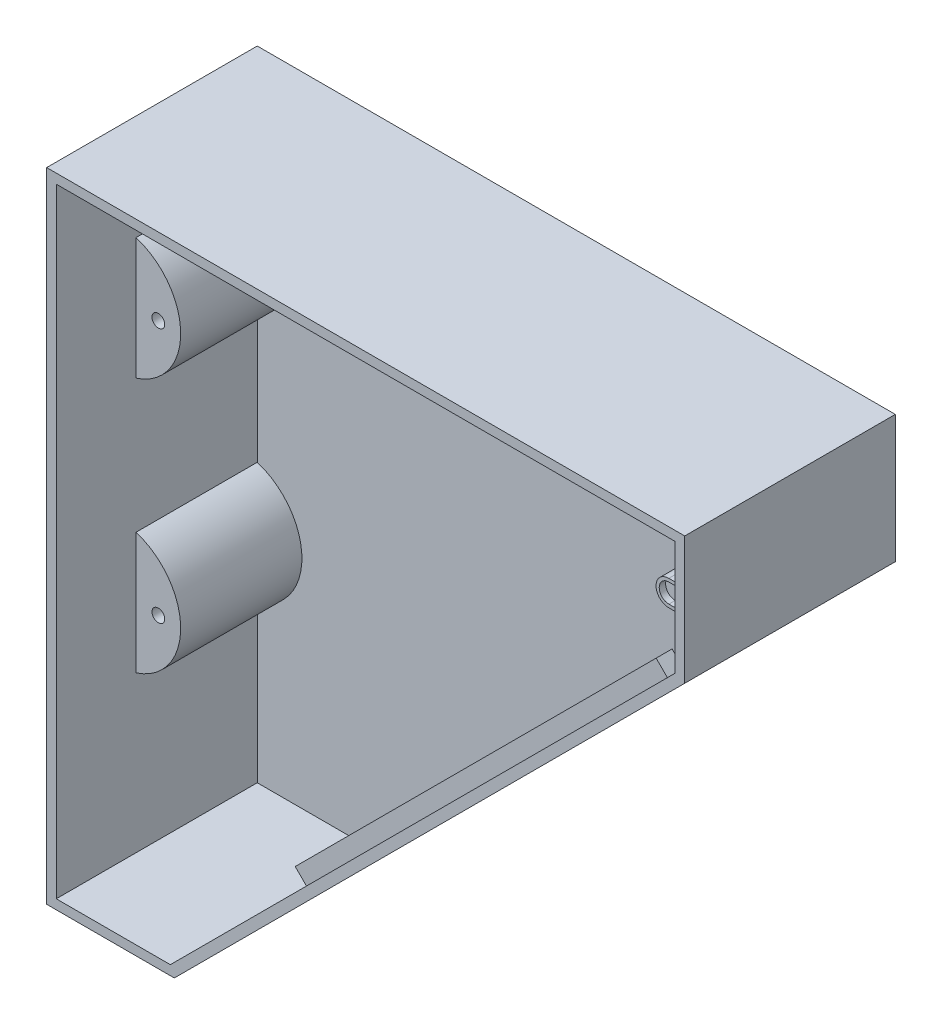
ISO-10303-21;
HEADER;
FILE_DESCRIPTION(('STEP AP214'),'2;1');
FILE_NAME('part.step','',(''),(''),'','','');
FILE_SCHEMA(('AUTOMOTIVE_DESIGN { 1 0 10303 214 1 1 1 1 }'));
ENDSEC;
DATA;
#1=APPLICATION_CONTEXT('core data for automotive mechanical design processes');
#2=APPLICATION_PROTOCOL_DEFINITION('international standard','automotive_design',2000,#1);
#3=PRODUCT_CONTEXT('',#1,'mechanical');
#4=PRODUCT('Part','Part','',(#3));
#5=PRODUCT_RELATED_PRODUCT_CATEGORY('part','',(#4));
#6=PRODUCT_DEFINITION_FORMATION('','',#4);
#7=PRODUCT_DEFINITION_CONTEXT('part definition',#1,'design');
#8=PRODUCT_DEFINITION('design','',#6,#7);
#9=PRODUCT_DEFINITION_SHAPE('','',#8);
#10=(LENGTH_UNIT() NAMED_UNIT(*) SI_UNIT(.MILLI.,.METRE.));
#11=(NAMED_UNIT(*) PLANE_ANGLE_UNIT() SI_UNIT($,.RADIAN.));
#12=(NAMED_UNIT(*) SI_UNIT($,.STERADIAN.) SOLID_ANGLE_UNIT());
#13=UNCERTAINTY_MEASURE_WITH_UNIT(LENGTH_MEASURE(1.E-05),#10,'distance_accuracy_value','');
#14=(GEOMETRIC_REPRESENTATION_CONTEXT(3) GLOBAL_UNCERTAINTY_ASSIGNED_CONTEXT((#13)) GLOBAL_UNIT_ASSIGNED_CONTEXT((#10,
#11,#12)) REPRESENTATION_CONTEXT('',''));
#15=CARTESIAN_POINT('',(0.,0.,0.));
#16=DIRECTION('',(0.,0.,1.));
#17=DIRECTION('',(1.,0.,0.));
#18=AXIS2_PLACEMENT_3D('',#15,#16,#17);
#19=CARTESIAN_POINT('',(197.,200.,70.));
#20=DIRECTION('',(-1.,0.,0.));
#21=DIRECTION('',(0.,0.,1.));
#22=AXIS2_PLACEMENT_3D('',#19,#20,#21);
#23=PLANE('',#22);
#24=DIRECTION('',(0.,1.,0.));
#25=VECTOR('',#24,1.);
#26=CARTESIAN_POINT('',(197.,176.,64.));
#27=LINE('',#26,#25);
#28=CARTESIAN_POINT('',(197.,176.,64.));
#29=VERTEX_POINT('',#28);
#30=CARTESIAN_POINT('',(197.,177.,64.));
#31=VERTEX_POINT('',#30);
#32=EDGE_CURVE('E248',#29,#31,#27,.T.);
#33=ORIENTED_EDGE('',*,*,#32,.F.);
#34=DIRECTION('',(0.,0.,1.));
#35=VECTOR('',#34,1.);
#36=CARTESIAN_POINT('',(197.,176.,3.));
#37=LINE('',#36,#35);
#38=CARTESIAN_POINT('',(197.,176.,3.));
#39=VERTEX_POINT('',#38);
#40=EDGE_CURVE('E60',#39,#29,#37,.T.);
#41=ORIENTED_EDGE('',*,*,#40,.F.);
#42=DIRECTION('',(0.,1.,0.));
#43=VECTOR('',#42,1.);
#44=CARTESIAN_POINT('',(197.,0.,3.));
#45=LINE('',#44,#43);
#46=CARTESIAN_POINT('',(197.,161.242640687119,3.));
#47=VERTEX_POINT('',#46);
#48=EDGE_CURVE('E443',#47,#39,#45,.T.);
#49=ORIENTED_EDGE('',*,*,#48,.F.);
#50=DIRECTION('',(0.,0.,-1.));
#51=VECTOR('',#50,1.);
#52=CARTESIAN_POINT('',(197.,161.242640687119,70.));
#53=LINE('',#52,#51);
#54=CARTESIAN_POINT('',(197.,161.242640687119,66.));
#55=VERTEX_POINT('',#54);
#56=EDGE_CURVE('E432',#55,#47,#53,.T.);
#57=ORIENTED_EDGE('',*,*,#56,.F.);
#58=DIRECTION('',(0.,-1.,0.));
#59=VECTOR('',#58,1.);
#60=CARTESIAN_POINT('',(197.,200.,66.));
#61=LINE('',#60,#59);
#62=CARTESIAN_POINT('',(197.,197.,66.));
#63=VERTEX_POINT('',#62);
#64=EDGE_CURVE('E413',#63,#55,#61,.T.);
#65=ORIENTED_EDGE('',*,*,#64,.F.);
#66=DIRECTION('',(0.,0.,-1.));
#67=VECTOR('',#66,1.);
#68=CARTESIAN_POINT('',(197.,197.,70.));
#69=LINE('',#68,#67);
#70=CARTESIAN_POINT('',(197.,197.,3.));
#71=VERTEX_POINT('',#70);
#72=EDGE_CURVE('E442',#63,#71,#69,.T.);
#73=ORIENTED_EDGE('',*,*,#72,.T.);
#74=CARTESIAN_POINT('',(197.,184.,3.));
#75=VERTEX_POINT('',#74);
#76=EDGE_CURVE('E440',#75,#71,#45,.T.);
#77=ORIENTED_EDGE('',*,*,#76,.F.);
#78=DIRECTION('',(0.,0.,1.));
#79=VECTOR('',#78,1.);
#80=CARTESIAN_POINT('',(197.,184.,3.));
#81=LINE('',#80,#79);
#82=CARTESIAN_POINT('',(197.,184.,64.));
#83=VERTEX_POINT('',#82);
#84=EDGE_CURVE('E297',#75,#83,#81,.T.);
#85=ORIENTED_EDGE('',*,*,#84,.T.);
#86=DIRECTION('',(0.,1.,0.));
#87=VECTOR('',#86,1.);
#88=CARTESIAN_POINT('',(197.,183.,64.));
#89=LINE('',#88,#87);
#90=CARTESIAN_POINT('',(197.,183.,64.));
#91=VERTEX_POINT('',#90);
#92=EDGE_CURVE('E269',#91,#83,#89,.T.);
#93=ORIENTED_EDGE('',*,*,#92,.F.);
#94=DIRECTION('',(0.,0.,-1.));
#95=VECTOR('',#94,1.);
#96=CARTESIAN_POINT('',(197.,183.,64.));
#97=LINE('',#96,#95);
#98=CARTESIAN_POINT('',(197.,183.,62.));
#99=VERTEX_POINT('',#98);
#100=EDGE_CURVE('E272',#91,#99,#97,.T.);
#101=ORIENTED_EDGE('',*,*,#100,.T.);
#102=DIRECTION('',(0.,1.,0.));
#103=VECTOR('',#102,1.);
#104=CARTESIAN_POINT('',(197.,184.,62.));
#105=LINE('',#104,#103);
#106=CARTESIAN_POINT('',(197.,177.,62.));
#107=VERTEX_POINT('',#106);
#108=EDGE_CURVE('E286',#107,#99,#105,.T.);
#109=ORIENTED_EDGE('',*,*,#108,.F.);
#110=DIRECTION('',(0.,0.,-1.));
#111=VECTOR('',#110,1.);
#112=CARTESIAN_POINT('',(197.,177.,64.));
#113=LINE('',#112,#111);
#114=EDGE_CURVE('E52',#31,#107,#113,.T.);
#115=ORIENTED_EDGE('',*,*,#114,.F.);
#116=EDGE_LOOP('',(#33,#41,#49,#57,#65,#73,#77,#85,#93,#101,#109,#115));
#117=FACE_BOUND('',#116,.T.);
#118=ADVANCED_FACE('F37',(#117),#23,.T.);
#119=CARTESIAN_POINT('',(193.,180.,62.));
#120=DIRECTION('',(0.,0.,1.));
#121=DIRECTION('',(1.,0.,0.));
#122=AXIS2_PLACEMENT_3D('',#119,#120,#121);
#123=PLANE('',#122);
#124=CARTESIAN_POINT('',(193.,180.,62.));
#125=DIRECTION('',(0.,0.,-1.));
#126=DIRECTION('',(1.,0.,0.));
#127=AXIS2_PLACEMENT_3D('',#124,#125,#126);
#128=CIRCLE('',#127,3.);
#129=CARTESIAN_POINT('',(193.,177.,62.));
#130=VERTEX_POINT('',#129);
#131=CARTESIAN_POINT('',(193.,183.,62.));
#132=VERTEX_POINT('',#131);
#133=EDGE_CURVE('E258',#130,#132,#128,.T.);
#134=ORIENTED_EDGE('',*,*,#133,.F.);
#135=DIRECTION('',(-1.,0.,0.));
#136=VECTOR('',#135,1.);
#137=CARTESIAN_POINT('',(193.,177.,62.));
#138=LINE('',#137,#136);
#139=EDGE_CURVE('E273',#107,#130,#138,.T.);
#140=ORIENTED_EDGE('',*,*,#139,.F.);
#141=ORIENTED_EDGE('',*,*,#108,.T.);
#142=DIRECTION('',(1.,0.,0.));
#143=VECTOR('',#142,1.);
#144=CARTESIAN_POINT('',(193.,183.,62.));
#145=LINE('',#144,#143);
#146=EDGE_CURVE('E255',#132,#99,#145,.T.);
#147=ORIENTED_EDGE('',*,*,#146,.F.);
#148=EDGE_LOOP('',(#134,#140,#141,#147));
#149=FACE_BOUND('',#148,.T.);
#150=ADVANCED_FACE('F516',(#149),#123,.T.);
#151=CARTESIAN_POINT('',(0.,197.,70.));
#152=DIRECTION('',(0.,-1.,0.));
#153=DIRECTION('',(0.,0.,-1.));
#154=AXIS2_PLACEMENT_3D('',#151,#152,#153);
#155=PLANE('',#154);
#156=DIRECTION('',(1.,0.,0.));
#157=VECTOR('',#156,1.);
#158=CARTESIAN_POINT('',(0.,197.,66.));
#159=LINE('',#158,#157);
#160=CARTESIAN_POINT('',(3.,197.,66.));
#161=VERTEX_POINT('',#160);
#162=EDGE_CURVE('E410',#161,#63,#159,.T.);
#163=ORIENTED_EDGE('',*,*,#162,.F.);
#164=DIRECTION('',(0.,0.,-1.));
#165=VECTOR('',#164,1.);
#166=CARTESIAN_POINT('',(3.,197.,70.));
#167=LINE('',#166,#165);
#168=CARTESIAN_POINT('',(3.,197.,3.));
#169=VERTEX_POINT('',#168);
#170=EDGE_CURVE('E436',#161,#169,#167,.T.);
#171=ORIENTED_EDGE('',*,*,#170,.T.);
#172=DIRECTION('',(-1.,0.,0.));
#173=VECTOR('',#172,1.);
#174=CARTESIAN_POINT('',(0.,197.,3.));
#175=LINE('',#174,#173);
#176=EDGE_CURVE('E446',#71,#169,#175,.T.);
#177=ORIENTED_EDGE('',*,*,#176,.F.);
#178=ORIENTED_EDGE('',*,*,#72,.F.);
#179=EDGE_LOOP('',(#163,#171,#177,#178));
#180=FACE_BOUND('',#179,.T.);
#181=DIRECTION('',(0.,0.,1.));
#182=VECTOR('',#181,1.);
#183=CARTESIAN_POINT('',(188.,197.,36.));
#184=LINE('',#183,#182);
#185=CARTESIAN_POINT('',(188.,197.,36.));
#186=VERTEX_POINT('',#185);
#187=CARTESIAN_POINT('',(188.,197.,41.));
#188=VERTEX_POINT('',#187);
#189=EDGE_CURVE('E358',#186,#188,#184,.T.);
#190=ORIENTED_EDGE('',*,*,#189,.F.);
#191=DIRECTION('',(-1.,0.,0.));
#192=VECTOR('',#191,1.);
#193=CARTESIAN_POINT('',(28.,197.,36.));
#194=LINE('',#193,#192);
#195=CARTESIAN_POINT('',(28.,197.,36.));
#196=VERTEX_POINT('',#195);
#197=EDGE_CURVE('E342',#186,#196,#194,.T.);
#198=ORIENTED_EDGE('',*,*,#197,.T.);
#199=DIRECTION('',(0.,0.,1.));
#200=VECTOR('',#199,1.);
#201=CARTESIAN_POINT('',(28.,197.,36.));
#202=LINE('',#201,#200);
#203=CARTESIAN_POINT('',(28.,197.,41.));
#204=VERTEX_POINT('',#203);
#205=EDGE_CURVE('E355',#196,#204,#202,.T.);
#206=ORIENTED_EDGE('',*,*,#205,.T.);
#207=DIRECTION('',(-1.,0.,0.));
#208=VECTOR('',#207,1.);
#209=CARTESIAN_POINT('',(28.,197.,41.));
#210=LINE('',#209,#208);
#211=EDGE_CURVE('E336',#188,#204,#210,.T.);
#212=ORIENTED_EDGE('',*,*,#211,.F.);
#213=EDGE_LOOP('',(#190,#198,#206,#212));
#214=FACE_BOUND('',#213,.T.);
#215=ADVANCED_FACE('F521',(#180,#214),#155,.T.);
#216=CARTESIAN_POINT('',(0.,0.,3.));
#217=DIRECTION('',(0.,0.,-1.));
#218=DIRECTION('',(-1.,0.,0.));
#219=AXIS2_PLACEMENT_3D('',#216,#217,#218);
#220=PLANE('',#219);
#221=CARTESIAN_POINT('',(193.,180.,3.));
#222=DIRECTION('',(0.,0.,1.));
#223=DIRECTION('',(1.,0.,0.));
#224=AXIS2_PLACEMENT_3D('',#221,#222,#223);
#225=CIRCLE('',#224,4.);
#226=CARTESIAN_POINT('',(193.,184.,3.));
#227=VERTEX_POINT('',#226);
#228=CARTESIAN_POINT('',(193.,176.,3.));
#229=VERTEX_POINT('',#228);
#230=EDGE_CURVE('E241',#227,#229,#225,.T.);
#231=ORIENTED_EDGE('',*,*,#230,.F.);
#232=DIRECTION('',(-1.,0.,0.));
#233=VECTOR('',#232,1.);
#234=CARTESIAN_POINT('',(193.,184.,3.));
#235=LINE('',#234,#233);
#236=EDGE_CURVE('E242',#75,#227,#235,.T.);
#237=ORIENTED_EDGE('',*,*,#236,.F.);
#238=ORIENTED_EDGE('',*,*,#76,.T.);
#239=ORIENTED_EDGE('',*,*,#176,.T.);
#240=DIRECTION('',(0.,-1.,0.));
#241=VECTOR('',#240,1.);
#242=CARTESIAN_POINT('',(3.,0.,3.));
#243=LINE('',#242,#241);
#244=CARTESIAN_POINT('',(3.,170.,3.));
#245=VERTEX_POINT('',#244);
#246=EDGE_CURVE('E437',#169,#245,#243,.T.);
#247=ORIENTED_EDGE('',*,*,#246,.T.);
#248=CARTESIAN_POINT('',(-3.,150.921215971661,3.));
#249=DIRECTION('',(0.,0.,-1.));
#250=DIRECTION('',(-1.,0.,0.));
#251=AXIS2_PLACEMENT_3D('',#248,#249,#250);
#252=CIRCLE('',#251,20.);
#253=CARTESIAN_POINT('',(2.99999999999917,131.842431943322,3.));
#254=VERTEX_POINT('',#253);
#255=EDGE_CURVE('E390',#245,#254,#252,.T.);
#256=ORIENTED_EDGE('',*,*,#255,.T.);
#257=CARTESIAN_POINT('',(3.00000000000083,90.,3.));
#258=VERTEX_POINT('',#257);
#259=EDGE_CURVE('E455',#254,#258,#243,.T.);
#260=ORIENTED_EDGE('',*,*,#259,.T.);
#261=CARTESIAN_POINT('',(-2.99999999999917,70.9212159716611,3.));
#262=DIRECTION('',(0.,0.,-1.));
#263=DIRECTION('',(-1.,0.,0.));
#264=AXIS2_PLACEMENT_3D('',#261,#262,#263);
#265=CIRCLE('',#264,20.);
#266=CARTESIAN_POINT('',(3.,51.8424319433219,3.));
#267=VERTEX_POINT('',#266);
#268=EDGE_CURVE('E381',#258,#267,#265,.T.);
#269=ORIENTED_EDGE('',*,*,#268,.T.);
#270=CARTESIAN_POINT('',(3.,3.,3.));
#271=VERTEX_POINT('',#270);
#272=EDGE_CURVE('E451',#267,#271,#243,.T.);
#273=ORIENTED_EDGE('',*,*,#272,.T.);
#274=DIRECTION('',(1.,0.,0.));
#275=VECTOR('',#274,1.);
#276=CARTESIAN_POINT('',(0.,3.,3.));
#277=LINE('',#276,#275);
#278=CARTESIAN_POINT('',(38.7573593128825,3.,3.));
#279=VERTEX_POINT('',#278);
#280=EDGE_CURVE('E425',#271,#279,#277,.T.);
#281=ORIENTED_EDGE('',*,*,#280,.T.);
#282=DIRECTION('',(0.707106781186544,0.707106781186551,0.));
#283=VECTOR('',#282,1.);
#284=CARTESIAN_POINT('',(17.8786796564414,-17.8786796564412,3.));
#285=LINE('',#284,#283);
#286=EDGE_CURVE('E428',#279,#47,#285,.T.);
#287=ORIENTED_EDGE('',*,*,#286,.T.);
#288=ORIENTED_EDGE('',*,*,#48,.T.);
#289=DIRECTION('',(1.,0.,0.));
#290=VECTOR('',#289,1.);
#291=CARTESIAN_POINT('',(193.,176.,3.));
#292=LINE('',#291,#290);
#293=EDGE_CURVE('E288',#229,#39,#292,.T.);
#294=ORIENTED_EDGE('',*,*,#293,.F.);
#295=EDGE_LOOP('',(#231,#237,#238,#239,#247,#256,#260,#269,#273,#281,#287,#288,#294));
#296=FACE_BOUND('',#295,.T.);
#297=ADVANCED_FACE('F527',(#296),#220,.F.);
#298=CARTESIAN_POINT('',(3.,0.,70.));
#299=DIRECTION('',(1.,0.,0.));
#300=DIRECTION('',(0.,0.,-1.));
#301=AXIS2_PLACEMENT_3D('',#298,#299,#300);
#302=PLANE('',#301);
#303=DIRECTION('',(0.,-1.,0.));
#304=VECTOR('',#303,1.);
#305=CARTESIAN_POINT('',(3.00000000000083,90.,41.));
#306=LINE('',#305,#304);
#307=CARTESIAN_POINT('',(3.,90.,41.));
#308=VERTEX_POINT('',#307);
#309=CARTESIAN_POINT('',(3.,51.8424319433219,41.));
#310=VERTEX_POINT('',#309);
#311=EDGE_CURVE('E382',#308,#310,#306,.T.);
#312=ORIENTED_EDGE('',*,*,#311,.F.);
#313=DIRECTION('',(0.,0.,1.));
#314=VECTOR('',#313,1.);
#315=CARTESIAN_POINT('',(3.00000000000083,90.,3.));
#316=LINE('',#315,#314);
#317=EDGE_CURVE('E378',#258,#308,#316,.T.);
#318=ORIENTED_EDGE('',*,*,#317,.F.);
#319=ORIENTED_EDGE('',*,*,#259,.F.);
#320=DIRECTION('',(0.,0.,1.));
#321=VECTOR('',#320,1.);
#322=CARTESIAN_POINT('',(2.99999999999917,131.842431943322,3.));
#323=LINE('',#322,#321);
#324=CARTESIAN_POINT('',(2.99999999999917,131.842431943322,41.));
#325=VERTEX_POINT('',#324);
#326=EDGE_CURVE('E400',#254,#325,#323,.T.);
#327=ORIENTED_EDGE('',*,*,#326,.T.);
#328=DIRECTION('',(0.,-1.,0.));
#329=VECTOR('',#328,1.);
#330=CARTESIAN_POINT('',(3.,170.,41.));
#331=LINE('',#330,#329);
#332=CARTESIAN_POINT('',(3.,170.,41.));
#333=VERTEX_POINT('',#332);
#334=EDGE_CURVE('E394',#333,#325,#331,.T.);
#335=ORIENTED_EDGE('',*,*,#334,.F.);
#336=DIRECTION('',(0.,0.,1.));
#337=VECTOR('',#336,1.);
#338=CARTESIAN_POINT('',(3.,170.,3.));
#339=LINE('',#338,#337);
#340=EDGE_CURVE('E393',#245,#333,#339,.T.);
#341=ORIENTED_EDGE('',*,*,#340,.F.);
#342=ORIENTED_EDGE('',*,*,#246,.F.);
#343=ORIENTED_EDGE('',*,*,#170,.F.);
#344=DIRECTION('',(0.,1.,0.));
#345=VECTOR('',#344,1.);
#346=CARTESIAN_POINT('',(3.,0.,66.));
#347=LINE('',#346,#345);
#348=CARTESIAN_POINT('',(3.,3.,66.));
#349=VERTEX_POINT('',#348);
#350=EDGE_CURVE('E11',#349,#161,#347,.T.);
#351=ORIENTED_EDGE('',*,*,#350,.F.);
#352=DIRECTION('',(0.,0.,-1.));
#353=VECTOR('',#352,1.);
#354=CARTESIAN_POINT('',(3.,3.,70.));
#355=LINE('',#354,#353);
#356=EDGE_CURVE('E433',#349,#271,#355,.T.);
#357=ORIENTED_EDGE('',*,*,#356,.T.);
#358=ORIENTED_EDGE('',*,*,#272,.F.);
#359=DIRECTION('',(0.,0.,1.));
#360=VECTOR('',#359,1.);
#361=CARTESIAN_POINT('',(3.,51.8424319433219,3.));
#362=LINE('',#361,#360);
#363=EDGE_CURVE('E367',#267,#310,#362,.T.);
#364=ORIENTED_EDGE('',*,*,#363,.T.);
#365=EDGE_LOOP('',(#312,#318,#319,#327,#335,#341,#342,#343,#351,#357,#358,#364));
#366=FACE_BOUND('',#365,.T.);
#367=ADVANCED_FACE('F529',(#366),#302,.T.);
#368=CARTESIAN_POINT('',(40.0000000000018,0.,70.));
#369=DIRECTION('',(0.,1.,0.));
#370=DIRECTION('',(-1.,0.,0.));
#371=AXIS2_PLACEMENT_3D('',#368,#369,#370);
#372=PLANE('',#371);
#373=DIRECTION('',(0.,0.,-1.));
#374=VECTOR('',#373,1.);
#375=CARTESIAN_POINT('',(40.0000000000018,0.,70.));
#376=LINE('',#375,#374);
#377=CARTESIAN_POINT('',(40.0000000000018,0.,66.));
#378=VERTEX_POINT('',#377);
#379=CARTESIAN_POINT('',(40.0000000000018,0.,0.));
#380=VERTEX_POINT('',#379);
#381=EDGE_CURVE('E45',#378,#380,#376,.T.);
#382=ORIENTED_EDGE('',*,*,#381,.F.);
#383=DIRECTION('',(1.,0.,0.));
#384=VECTOR('',#383,1.);
#385=CARTESIAN_POINT('',(0.,0.,66.));
#386=LINE('',#385,#384);
#387=CARTESIAN_POINT('',(0.,0.,66.));
#388=VERTEX_POINT('',#387);
#389=EDGE_CURVE('E406',#388,#378,#386,.T.);
#390=ORIENTED_EDGE('',*,*,#389,.F.);
#391=DIRECTION('',(0.,0.,-1.));
#392=VECTOR('',#391,1.);
#393=CARTESIAN_POINT('',(0.,0.,70.));
#394=LINE('',#393,#392);
#395=CARTESIAN_POINT('',(0.,0.,0.));
#396=VERTEX_POINT('',#395);
#397=EDGE_CURVE('E470',#388,#396,#394,.T.);
#398=ORIENTED_EDGE('',*,*,#397,.T.);
#399=DIRECTION('',(1.,0.,0.));
#400=VECTOR('',#399,1.);
#401=CARTESIAN_POINT('',(40.0000000000018,0.,0.));
#402=LINE('',#401,#400);
#403=EDGE_CURVE('E431',#396,#380,#402,.T.);
#404=ORIENTED_EDGE('',*,*,#403,.T.);
#405=EDGE_LOOP('',(#382,#390,#398,#404));
#406=FACE_BOUND('',#405,.T.);
#407=ADVANCED_FACE('F39',(#406),#372,.F.);
#408=CARTESIAN_POINT('',(200.,160.,70.));
#409=DIRECTION('',(-0.707106781186551,0.707106781186544,0.));
#410=DIRECTION('',(-0.707106781186544,-0.707106781186551,0.));
#411=AXIS2_PLACEMENT_3D('',#408,#409,#410);
#412=PLANE('',#411);
#413=DIRECTION('',(0.,0.,-1.));
#414=VECTOR('',#413,1.);
#415=CARTESIAN_POINT('',(200.,160.,70.));
#416=LINE('',#415,#414);
#417=CARTESIAN_POINT('',(200.,160.,66.));
#418=VERTEX_POINT('',#417);
#419=CARTESIAN_POINT('',(200.,160.,0.));
#420=VERTEX_POINT('',#419);
#421=EDGE_CURVE('E476',#418,#420,#416,.T.);
#422=ORIENTED_EDGE('',*,*,#421,.F.);
#423=DIRECTION('',(-0.707106781186544,-0.707106781186551,0.));
#424=VECTOR('',#423,1.);
#425=CARTESIAN_POINT('',(200.,160.,66.));
#426=LINE('',#425,#424);
#427=EDGE_CURVE('E422',#418,#378,#426,.T.);
#428=ORIENTED_EDGE('',*,*,#427,.T.);
#429=ORIENTED_EDGE('',*,*,#381,.T.);
#430=DIRECTION('',(0.707106781186544,0.707106781186551,0.));
#431=VECTOR('',#430,1.);
#432=CARTESIAN_POINT('',(200.,160.,0.));
#433=LINE('',#432,#431);
#434=EDGE_CURVE('E458',#380,#420,#433,.T.);
#435=ORIENTED_EDGE('',*,*,#434,.T.);
#436=EDGE_LOOP('',(#422,#428,#429,#435));
#437=FACE_BOUND('',#436,.T.);
#438=ADVANCED_FACE('F481',(#437),#412,.F.);
#439=CARTESIAN_POINT('',(200.,200.,70.));
#440=DIRECTION('',(-1.,0.,0.));
#441=DIRECTION('',(0.,0.,1.));
#442=AXIS2_PLACEMENT_3D('',#439,#440,#441);
#443=PLANE('',#442);
#444=DIRECTION('',(0.,0.,-1.));
#445=VECTOR('',#444,1.);
#446=CARTESIAN_POINT('',(200.,200.,70.));
#447=LINE('',#446,#445);
#448=CARTESIAN_POINT('',(200.,200.,66.));
#449=VERTEX_POINT('',#448);
#450=CARTESIAN_POINT('',(200.,200.,0.));
#451=VERTEX_POINT('',#450);
#452=EDGE_CURVE('E474',#449,#451,#447,.T.);
#453=ORIENTED_EDGE('',*,*,#452,.F.);
#454=DIRECTION('',(0.,-1.,0.));
#455=VECTOR('',#454,1.);
#456=CARTESIAN_POINT('',(200.,200.,66.));
#457=LINE('',#456,#455);
#458=EDGE_CURVE('E419',#449,#418,#457,.T.);
#459=ORIENTED_EDGE('',*,*,#458,.T.);
#460=ORIENTED_EDGE('',*,*,#421,.T.);
#461=DIRECTION('',(0.,1.,0.));
#462=VECTOR('',#461,1.);
#463=CARTESIAN_POINT('',(200.,200.,0.));
#464=LINE('',#463,#462);
#465=EDGE_CURVE('E461',#420,#451,#464,.T.);
#466=ORIENTED_EDGE('',*,*,#465,.T.);
#467=EDGE_LOOP('',(#453,#459,#460,#466));
#468=FACE_BOUND('',#467,.T.);
#469=ADVANCED_FACE('F498',(#468),#443,.F.);
#470=CARTESIAN_POINT('',(0.,200.,70.));
#471=DIRECTION('',(0.,-1.,0.));
#472=DIRECTION('',(0.,0.,-1.));
#473=AXIS2_PLACEMENT_3D('',#470,#471,#472);
#474=PLANE('',#473);
#475=DIRECTION('',(0.,0.,-1.));
#476=VECTOR('',#475,1.);
#477=CARTESIAN_POINT('',(0.,200.,70.));
#478=LINE('',#477,#476);
#479=CARTESIAN_POINT('',(0.,200.,66.));
#480=VERTEX_POINT('',#479);
#481=CARTESIAN_POINT('',(0.,200.,0.));
#482=VERTEX_POINT('',#481);
#483=EDGE_CURVE('E472',#480,#482,#478,.T.);
#484=ORIENTED_EDGE('',*,*,#483,.F.);
#485=DIRECTION('',(1.,0.,0.));
#486=VECTOR('',#485,1.);
#487=CARTESIAN_POINT('',(0.,200.,66.));
#488=LINE('',#487,#486);
#489=EDGE_CURVE('E407',#480,#449,#488,.T.);
#490=ORIENTED_EDGE('',*,*,#489,.T.);
#491=ORIENTED_EDGE('',*,*,#452,.T.);
#492=DIRECTION('',(-1.,0.,0.));
#493=VECTOR('',#492,1.);
#494=CARTESIAN_POINT('',(0.,200.,0.));
#495=LINE('',#494,#493);
#496=EDGE_CURVE('E464',#451,#482,#495,.T.);
#497=ORIENTED_EDGE('',*,*,#496,.T.);
#498=EDGE_LOOP('',(#484,#490,#491,#497));
#499=FACE_BOUND('',#498,.T.);
#500=ADVANCED_FACE('F495',(#499),#474,.F.);
#501=CARTESIAN_POINT('',(0.,0.,70.));
#502=DIRECTION('',(1.,0.,0.));
#503=DIRECTION('',(0.,0.,-1.));
#504=AXIS2_PLACEMENT_3D('',#501,#502,#503);
#505=PLANE('',#504);
#506=ORIENTED_EDGE('',*,*,#397,.F.);
#507=DIRECTION('',(0.,1.,0.));
#508=VECTOR('',#507,1.);
#509=CARTESIAN_POINT('',(0.,200.,66.));
#510=LINE('',#509,#508);
#511=EDGE_CURVE('E403',#388,#480,#510,.T.);
#512=ORIENTED_EDGE('',*,*,#511,.T.);
#513=ORIENTED_EDGE('',*,*,#483,.T.);
#514=DIRECTION('',(0.,-1.,0.));
#515=VECTOR('',#514,1.);
#516=CARTESIAN_POINT('',(0.,0.,0.));
#517=LINE('',#516,#515);
#518=EDGE_CURVE('E467',#482,#396,#517,.T.);
#519=ORIENTED_EDGE('',*,*,#518,.T.);
#520=EDGE_LOOP('',(#506,#512,#513,#519));
#521=FACE_BOUND('',#520,.T.);
#522=ADVANCED_FACE('F492',(#521),#505,.F.);
#523=CARTESIAN_POINT('',(0.,0.,0.));
#524=DIRECTION('',(0.,0.,-1.));
#525=DIRECTION('',(-1.,0.,0.));
#526=AXIS2_PLACEMENT_3D('',#523,#524,#525);
#527=PLANE('',#526);
#528=ORIENTED_EDGE('',*,*,#403,.F.);
#529=ORIENTED_EDGE('',*,*,#518,.F.);
#530=ORIENTED_EDGE('',*,*,#496,.F.);
#531=ORIENTED_EDGE('',*,*,#465,.F.);
#532=ORIENTED_EDGE('',*,*,#434,.F.);
#533=EDGE_LOOP('',(#528,#529,#530,#531,#532));
#534=FACE_BOUND('',#533,.T.);
#535=ADVANCED_FACE('F487',(#534),#527,.T.);
#536=CARTESIAN_POINT('',(0.,200.,66.));
#537=DIRECTION('',(0.,0.,-1.));
#538=DIRECTION('',(0.,1.,0.));
#539=AXIS2_PLACEMENT_3D('',#536,#537,#538);
#540=PLANE('',#539);
#541=DIRECTION('',(-1.,0.,0.));
#542=VECTOR('',#541,1.);
#543=CARTESIAN_POINT('',(40.0000000000018,3.,66.));
#544=LINE('',#543,#542);
#545=CARTESIAN_POINT('',(38.7573593128825,3.,66.));
#546=VERTEX_POINT('',#545);
#547=EDGE_CURVE('E417',#546,#349,#544,.T.);
#548=ORIENTED_EDGE('',*,*,#547,.T.);
#549=ORIENTED_EDGE('',*,*,#350,.T.);
#550=ORIENTED_EDGE('',*,*,#162,.T.);
#551=ORIENTED_EDGE('',*,*,#64,.T.);
#552=DIRECTION('',(-0.707106781186544,-0.707106781186551,0.));
#553=VECTOR('',#552,1.);
#554=CARTESIAN_POINT('',(197.87867965644,162.12132034356,66.));
#555=LINE('',#554,#553);
#556=EDGE_CURVE('E415',#55,#546,#555,.T.);
#557=ORIENTED_EDGE('',*,*,#556,.T.);
#558=EDGE_LOOP('',(#548,#549,#550,#551,#557));
#559=FACE_BOUND('',#558,.T.);
#560=ORIENTED_EDGE('',*,*,#458,.F.);
#561=ORIENTED_EDGE('',*,*,#489,.F.);
#562=ORIENTED_EDGE('',*,*,#511,.F.);
#563=ORIENTED_EDGE('',*,*,#389,.T.);
#564=ORIENTED_EDGE('',*,*,#427,.F.);
#565=EDGE_LOOP('',(#560,#561,#562,#563,#564));
#566=FACE_BOUND('',#565,.T.);
#567=ADVANCED_FACE('F500',(#559,#566),#540,.F.);
#568=CARTESIAN_POINT('',(197.87867965644,162.12132034356,70.));
#569=DIRECTION('',(-0.707106781186551,0.707106781186544,0.));
#570=DIRECTION('',(-0.707106781186544,-0.707106781186551,0.));
#571=AXIS2_PLACEMENT_3D('',#568,#569,#570);
#572=PLANE('',#571);
#573=DIRECTION('',(0.707106781186547,0.707106781186548,0.));
#574=VECTOR('',#573,1.);
#575=CARTESIAN_POINT('',(169.572113832394,133.814754519511,36.));
#576=LINE('',#575,#574);
#577=CARTESIAN_POINT('',(56.4350288425462,20.6776695296637,36.));
#578=VERTEX_POINT('',#577);
#579=CARTESIAN_POINT('',(169.572113832394,133.814754519511,36.));
#580=VERTEX_POINT('',#579);
#581=EDGE_CURVE('E309',#578,#580,#576,.T.);
#582=ORIENTED_EDGE('',*,*,#581,.T.);
#583=DIRECTION('',(0.,0.,1.));
#584=VECTOR('',#583,1.);
#585=CARTESIAN_POINT('',(169.572113832394,133.814754519511,36.));
#586=LINE('',#585,#584);
#587=CARTESIAN_POINT('',(169.572113832394,133.814754519511,41.));
#588=VERTEX_POINT('',#587);
#589=EDGE_CURVE('E322',#580,#588,#586,.T.);
#590=ORIENTED_EDGE('',*,*,#589,.T.);
#591=DIRECTION('',(0.707106781186547,0.707106781186548,0.));
#592=VECTOR('',#591,1.);
#593=CARTESIAN_POINT('',(169.572113832394,133.814754519511,41.));
#594=LINE('',#593,#592);
#595=CARTESIAN_POINT('',(56.4350288425459,20.6776695296637,41.));
#596=VERTEX_POINT('',#595);
#597=EDGE_CURVE('E304',#596,#588,#594,.T.);
#598=ORIENTED_EDGE('',*,*,#597,.F.);
#599=DIRECTION('',(0.,0.,1.));
#600=VECTOR('',#599,1.);
#601=CARTESIAN_POINT('',(56.4350288425462,20.6776695296637,36.));
#602=LINE('',#601,#600);
#603=EDGE_CURVE('E326',#578,#596,#602,.T.);
#604=ORIENTED_EDGE('',*,*,#603,.F.);
#605=EDGE_LOOP('',(#582,#590,#598,#604));
#606=FACE_BOUND('',#605,.T.);
#607=ORIENTED_EDGE('',*,*,#556,.F.);
#608=ORIENTED_EDGE('',*,*,#56,.T.);
#609=ORIENTED_EDGE('',*,*,#286,.F.);
#610=DIRECTION('',(0.,0.,-1.));
#611=VECTOR('',#610,1.);
#612=CARTESIAN_POINT('',(38.7573593128825,3.,70.));
#613=LINE('',#612,#611);
#614=EDGE_CURVE('E429',#546,#279,#613,.T.);
#615=ORIENTED_EDGE('',*,*,#614,.F.);
#616=EDGE_LOOP('',(#607,#608,#609,#615));
#617=FACE_BOUND('',#616,.T.);
#618=ADVANCED_FACE('F502',(#606,#617),#572,.T.);
#619=CARTESIAN_POINT('',(40.0000000000018,3.,70.));
#620=DIRECTION('',(0.,1.,0.));
#621=DIRECTION('',(-1.,0.,0.));
#622=AXIS2_PLACEMENT_3D('',#619,#620,#621);
#623=PLANE('',#622);
#624=ORIENTED_EDGE('',*,*,#547,.F.);
#625=ORIENTED_EDGE('',*,*,#614,.T.);
#626=ORIENTED_EDGE('',*,*,#280,.F.);
#627=ORIENTED_EDGE('',*,*,#356,.F.);
#628=EDGE_LOOP('',(#624,#625,#626,#627));
#629=FACE_BOUND('',#628,.T.);
#630=ADVANCED_FACE('F509',(#629),#623,.T.);
#631=CARTESIAN_POINT('',(-3.,150.921215971661,3.));
#632=DIRECTION('',(0.,0.,1.));
#633=DIRECTION('',(1.,0.,0.));
#634=AXIS2_PLACEMENT_3D('',#631,#632,#633);
#635=CYLINDRICAL_SURFACE('',#634,20.);
#636=CARTESIAN_POINT('',(-3.,150.921215971661,41.));
#637=DIRECTION('',(0.,0.,-1.));
#638=DIRECTION('',(-1.,0.,0.));
#639=AXIS2_PLACEMENT_3D('',#636,#637,#638);
#640=CIRCLE('',#639,20.);
#641=EDGE_CURVE('E387',#333,#325,#640,.T.);
#642=ORIENTED_EDGE('',*,*,#641,.T.);
#643=ORIENTED_EDGE('',*,*,#326,.F.);
#644=ORIENTED_EDGE('',*,*,#255,.F.);
#645=ORIENTED_EDGE('',*,*,#340,.T.);
#646=EDGE_LOOP('',(#642,#643,#644,#645));
#647=FACE_BOUND('',#646,.T.);
#648=ADVANCED_FACE('F710',(#647),#635,.T.);
#649=CARTESIAN_POINT('',(-3.,150.921215971661,41.));
#650=DIRECTION('',(0.,0.,-1.));
#651=DIRECTION('',(-1.,0.,0.));
#652=AXIS2_PLACEMENT_3D('',#649,#650,#651);
#653=PLANE('',#652);
#654=CARTESIAN_POINT('',(10.,150.921215971661,41.));
#655=DIRECTION('',(0.,0.,1.));
#656=DIRECTION('',(1.,0.,0.));
#657=AXIS2_PLACEMENT_3D('',#654,#655,#656);
#658=CIRCLE('',#657,2.);
#659=CARTESIAN_POINT('',(12.,150.921215971661,41.));
#660=VERTEX_POINT('',#659);
#661=EDGE_CURVE('E368',#660,#660,#658,.T.);
#662=ORIENTED_EDGE('',*,*,#661,.F.);
#663=EDGE_LOOP('',(#662));
#664=FACE_BOUND('',#663,.T.);
#665=ORIENTED_EDGE('',*,*,#641,.F.);
#666=ORIENTED_EDGE('',*,*,#334,.T.);
#667=EDGE_LOOP('',(#665,#666));
#668=FACE_BOUND('',#667,.T.);
#669=ADVANCED_FACE('F704',(#664,#668),#653,.F.);
#670=CARTESIAN_POINT('',(-2.99999999999917,70.9212159716611,3.));
#671=DIRECTION('',(0.,0.,1.));
#672=DIRECTION('',(1.,0.,0.));
#673=AXIS2_PLACEMENT_3D('',#670,#671,#672);
#674=CYLINDRICAL_SURFACE('',#673,20.);
#675=CARTESIAN_POINT('',(-2.99999999999917,70.9212159716611,41.));
#676=DIRECTION('',(0.,0.,-1.));
#677=DIRECTION('',(-1.,0.,0.));
#678=AXIS2_PLACEMENT_3D('',#675,#676,#677);
#679=CIRCLE('',#678,20.);
#680=EDGE_CURVE('E385',#308,#310,#679,.T.);
#681=ORIENTED_EDGE('',*,*,#680,.T.);
#682=ORIENTED_EDGE('',*,*,#363,.F.);
#683=ORIENTED_EDGE('',*,*,#268,.F.);
#684=ORIENTED_EDGE('',*,*,#317,.T.);
#685=EDGE_LOOP('',(#681,#682,#683,#684));
#686=FACE_BOUND('',#685,.T.);
#687=ADVANCED_FACE('F701',(#686),#674,.T.);
#688=CARTESIAN_POINT('',(-2.99999999999917,70.9212159716611,41.));
#689=DIRECTION('',(0.,0.,-1.));
#690=DIRECTION('',(-1.,0.,0.));
#691=AXIS2_PLACEMENT_3D('',#688,#689,#690);
#692=PLANE('',#691);
#693=CARTESIAN_POINT('',(10.0000000000008,70.9212159716611,41.));
#694=DIRECTION('',(0.,0.,1.));
#695=DIRECTION('',(1.,0.,0.));
#696=AXIS2_PLACEMENT_3D('',#693,#694,#695);
#697=CIRCLE('',#696,2.);
#698=CARTESIAN_POINT('',(12.0000000000008,70.9212159716611,41.));
#699=VERTEX_POINT('',#698);
#700=EDGE_CURVE('E357',#699,#699,#697,.T.);
#701=ORIENTED_EDGE('',*,*,#700,.F.);
#702=EDGE_LOOP('',(#701));
#703=FACE_BOUND('',#702,.T.);
#704=ORIENTED_EDGE('',*,*,#680,.F.);
#705=ORIENTED_EDGE('',*,*,#311,.T.);
#706=EDGE_LOOP('',(#704,#705));
#707=FACE_BOUND('',#706,.T.);
#708=ADVANCED_FACE('F699',(#703,#707),#692,.F.);
#709=CARTESIAN_POINT('',(10.0000000000008,70.9212159716611,11.));
#710=DIRECTION('',(0.,0.,1.));
#711=DIRECTION('',(1.,0.,0.));
#712=AXIS2_PLACEMENT_3D('',#709,#710,#711);
#713=CYLINDRICAL_SURFACE('',#712,2.);
#714=CARTESIAN_POINT('',(10.0000000000008,70.9212159716611,11.));
#715=DIRECTION('',(0.,0.,1.));
#716=DIRECTION('',(1.,0.,0.));
#717=AXIS2_PLACEMENT_3D('',#714,#715,#716);
#718=CIRCLE('',#717,2.);
#719=CARTESIAN_POINT('',(12.0000000000008,70.9212159716611,11.));
#720=VERTEX_POINT('',#719);
#721=EDGE_CURVE('E371',#720,#720,#718,.T.);
#722=ORIENTED_EDGE('',*,*,#721,.F.);
#723=EDGE_LOOP('',(#722));
#724=FACE_BOUND('',#723,.T.);
#725=ORIENTED_EDGE('',*,*,#700,.T.);
#726=EDGE_LOOP('',(#725));
#727=FACE_BOUND('',#726,.T.);
#728=ADVANCED_FACE('F695',(#724,#727),#713,.F.);
#729=CARTESIAN_POINT('',(10.0000000000008,70.9212159716611,11.));
#730=DIRECTION('',(0.,0.,1.));
#731=DIRECTION('',(1.,0.,0.));
#732=AXIS2_PLACEMENT_3D('',#729,#730,#731);
#733=PLANE('',#732);
#734=ORIENTED_EDGE('',*,*,#721,.T.);
#735=EDGE_LOOP('',(#734));
#736=FACE_BOUND('',#735,.T.);
#737=ADVANCED_FACE('F691',(#736),#733,.T.);
#738=CARTESIAN_POINT('',(10.,150.921215971661,11.));
#739=DIRECTION('',(0.,0.,1.));
#740=DIRECTION('',(1.,0.,0.));
#741=AXIS2_PLACEMENT_3D('',#738,#739,#740);
#742=CYLINDRICAL_SURFACE('',#741,2.);
#743=CARTESIAN_POINT('',(10.,150.921215971661,11.));
#744=DIRECTION('',(0.,0.,1.));
#745=DIRECTION('',(1.,0.,0.));
#746=AXIS2_PLACEMENT_3D('',#743,#744,#745);
#747=CIRCLE('',#746,2.);
#748=CARTESIAN_POINT('',(12.,150.921215971661,11.));
#749=VERTEX_POINT('',#748);
#750=EDGE_CURVE('E364',#749,#749,#747,.T.);
#751=ORIENTED_EDGE('',*,*,#750,.F.);
#752=EDGE_LOOP('',(#751));
#753=FACE_BOUND('',#752,.T.);
#754=ORIENTED_EDGE('',*,*,#661,.T.);
#755=EDGE_LOOP('',(#754));
#756=FACE_BOUND('',#755,.T.);
#757=ADVANCED_FACE('F687',(#753,#756),#742,.F.);
#758=CARTESIAN_POINT('',(10.,150.921215971661,11.));
#759=DIRECTION('',(0.,0.,1.));
#760=DIRECTION('',(1.,0.,0.));
#761=AXIS2_PLACEMENT_3D('',#758,#759,#760);
#762=PLANE('',#761);
#763=ORIENTED_EDGE('',*,*,#750,.T.);
#764=EDGE_LOOP('',(#763));
#765=FACE_BOUND('',#764,.T.);
#766=ADVANCED_FACE('F683',(#765),#762,.T.);
#767=CARTESIAN_POINT('',(28.,197.,36.));
#768=DIRECTION('',(-1.,0.,0.));
#769=DIRECTION('',(0.,0.,1.));
#770=AXIS2_PLACEMENT_3D('',#767,#768,#769);
#771=PLANE('',#770);
#772=DIRECTION('',(0.,-1.,0.));
#773=VECTOR('',#772,1.);
#774=CARTESIAN_POINT('',(28.,197.,41.));
#775=LINE('',#774,#773);
#776=CARTESIAN_POINT('',(28.,192.,41.));
#777=VERTEX_POINT('',#776);
#778=EDGE_CURVE('E325',#204,#777,#775,.T.);
#779=ORIENTED_EDGE('',*,*,#778,.F.);
#780=ORIENTED_EDGE('',*,*,#205,.F.);
#781=DIRECTION('',(0.,-1.,0.));
#782=VECTOR('',#781,1.);
#783=CARTESIAN_POINT('',(28.,197.,36.));
#784=LINE('',#783,#782);
#785=CARTESIAN_POINT('',(28.,192.,36.));
#786=VERTEX_POINT('',#785);
#787=EDGE_CURVE('E332',#196,#786,#784,.T.);
#788=ORIENTED_EDGE('',*,*,#787,.T.);
#789=DIRECTION('',(0.,0.,1.));
#790=VECTOR('',#789,1.);
#791=CARTESIAN_POINT('',(28.,192.,36.));
#792=LINE('',#791,#790);
#793=EDGE_CURVE('E344',#786,#777,#792,.T.);
#794=ORIENTED_EDGE('',*,*,#793,.T.);
#795=EDGE_LOOP('',(#779,#780,#788,#794));
#796=FACE_BOUND('',#795,.T.);
#797=ADVANCED_FACE('F676',(#796),#771,.T.);
#798=CARTESIAN_POINT('',(188.,197.,36.));
#799=DIRECTION('',(1.,0.,0.));
#800=DIRECTION('',(0.,1.,0.));
#801=AXIS2_PLACEMENT_3D('',#798,#799,#800);
#802=PLANE('',#801);
#803=DIRECTION('',(0.,1.,0.));
#804=VECTOR('',#803,1.);
#805=CARTESIAN_POINT('',(188.,197.,41.));
#806=LINE('',#805,#804);
#807=CARTESIAN_POINT('',(188.,192.,41.));
#808=VERTEX_POINT('',#807);
#809=EDGE_CURVE('E350',#808,#188,#806,.T.);
#810=ORIENTED_EDGE('',*,*,#809,.F.);
#811=DIRECTION('',(0.,0.,1.));
#812=VECTOR('',#811,1.);
#813=CARTESIAN_POINT('',(188.,192.,36.));
#814=LINE('',#813,#812);
#815=CARTESIAN_POINT('',(188.,192.,36.));
#816=VERTEX_POINT('',#815);
#817=EDGE_CURVE('E361',#816,#808,#814,.T.);
#818=ORIENTED_EDGE('',*,*,#817,.F.);
#819=DIRECTION('',(0.,1.,0.));
#820=VECTOR('',#819,1.);
#821=CARTESIAN_POINT('',(188.,197.,36.));
#822=LINE('',#821,#820);
#823=EDGE_CURVE('E339',#816,#186,#822,.T.);
#824=ORIENTED_EDGE('',*,*,#823,.T.);
#825=ORIENTED_EDGE('',*,*,#189,.T.);
#826=EDGE_LOOP('',(#810,#818,#824,#825));
#827=FACE_BOUND('',#826,.T.);
#828=ADVANCED_FACE('F673',(#827),#802,.T.);
#829=CARTESIAN_POINT('',(28.,192.,36.));
#830=DIRECTION('',(0.,-1.,0.));
#831=DIRECTION('',(1.,0.,0.));
#832=AXIS2_PLACEMENT_3D('',#829,#830,#831);
#833=PLANE('',#832);
#834=DIRECTION('',(1.,0.,0.));
#835=VECTOR('',#834,1.);
#836=CARTESIAN_POINT('',(28.,192.,41.));
#837=LINE('',#836,#835);
#838=EDGE_CURVE('E347',#777,#808,#837,.T.);
#839=ORIENTED_EDGE('',*,*,#838,.F.);
#840=ORIENTED_EDGE('',*,*,#793,.F.);
#841=DIRECTION('',(1.,0.,0.));
#842=VECTOR('',#841,1.);
#843=CARTESIAN_POINT('',(28.,192.,36.));
#844=LINE('',#843,#842);
#845=EDGE_CURVE('E335',#786,#816,#844,.T.);
#846=ORIENTED_EDGE('',*,*,#845,.T.);
#847=ORIENTED_EDGE('',*,*,#817,.T.);
#848=EDGE_LOOP('',(#839,#840,#846,#847));
#849=FACE_BOUND('',#848,.T.);
#850=ADVANCED_FACE('F668',(#849),#833,.T.);
#851=CARTESIAN_POINT('',(0.,0.,36.));
#852=DIRECTION('',(0.,0.,1.));
#853=DIRECTION('',(1.,0.,0.));
#854=AXIS2_PLACEMENT_3D('',#851,#852,#853);
#855=PLANE('',#854);
#856=ORIENTED_EDGE('',*,*,#787,.F.);
#857=ORIENTED_EDGE('',*,*,#197,.F.);
#858=ORIENTED_EDGE('',*,*,#823,.F.);
#859=ORIENTED_EDGE('',*,*,#845,.F.);
#860=EDGE_LOOP('',(#856,#857,#858,#859));
#861=FACE_BOUND('',#860,.T.);
#862=ADVANCED_FACE('F665',(#861),#855,.F.);
#863=CARTESIAN_POINT('',(0.,0.,41.));
#864=DIRECTION('',(0.,0.,1.));
#865=DIRECTION('',(1.,0.,0.));
#866=AXIS2_PLACEMENT_3D('',#863,#864,#865);
#867=PLANE('',#866);
#868=ORIENTED_EDGE('',*,*,#778,.T.);
#869=ORIENTED_EDGE('',*,*,#838,.T.);
#870=ORIENTED_EDGE('',*,*,#809,.T.);
#871=ORIENTED_EDGE('',*,*,#211,.T.);
#872=EDGE_LOOP('',(#868,#869,#870,#871));
#873=FACE_BOUND('',#872,.T.);
#874=ADVANCED_FACE('F663',(#873),#867,.T.);
#875=CARTESIAN_POINT('',(166.036579926461,137.350288425444,36.));
#876=DIRECTION('',(0.707106781186542,0.707106781186553,0.));
#877=DIRECTION('',(-0.707106781186553,0.707106781186542,0.));
#878=AXIS2_PLACEMENT_3D('',#875,#876,#877);
#879=PLANE('',#878);
#880=DIRECTION('',(-0.707106781186553,0.707106781186542,0.));
#881=VECTOR('',#880,1.);
#882=CARTESIAN_POINT('',(166.036579926461,137.350288425444,41.));
#883=LINE('',#882,#881);
#884=CARTESIAN_POINT('',(166.036579926461,137.350288425444,41.));
#885=VERTEX_POINT('',#884);
#886=EDGE_CURVE('E296',#588,#885,#883,.T.);
#887=ORIENTED_EDGE('',*,*,#886,.F.);
#888=ORIENTED_EDGE('',*,*,#589,.F.);
#889=DIRECTION('',(-0.707106781186553,0.707106781186542,0.));
#890=VECTOR('',#889,1.);
#891=CARTESIAN_POINT('',(166.036579926461,137.350288425444,36.));
#892=LINE('',#891,#890);
#893=CARTESIAN_POINT('',(166.036579926461,137.350288425444,36.));
#894=VERTEX_POINT('',#893);
#895=EDGE_CURVE('E300',#580,#894,#892,.T.);
#896=ORIENTED_EDGE('',*,*,#895,.T.);
#897=DIRECTION('',(0.,0.,1.));
#898=VECTOR('',#897,1.);
#899=CARTESIAN_POINT('',(166.036579926461,137.350288425444,36.));
#900=LINE('',#899,#898);
#901=EDGE_CURVE('E312',#894,#885,#900,.T.);
#902=ORIENTED_EDGE('',*,*,#901,.T.);
#903=EDGE_LOOP('',(#887,#888,#896,#902));
#904=FACE_BOUND('',#903,.T.);
#905=ADVANCED_FACE('F656',(#904),#879,.T.);
#906=CARTESIAN_POINT('',(56.4350288425462,20.6776695296637,36.));
#907=DIRECTION('',(-0.707106781186548,-0.707106781186547,0.));
#908=DIRECTION('',(0.707106781186547,-0.707106781186548,0.));
#909=AXIS2_PLACEMENT_3D('',#906,#907,#908);
#910=PLANE('',#909);
#911=DIRECTION('',(0.707106781186547,-0.707106781186548,0.));
#912=VECTOR('',#911,1.);
#913=CARTESIAN_POINT('',(56.4350288425462,20.6776695296637,41.));
#914=LINE('',#913,#912);
#915=CARTESIAN_POINT('',(52.8994949366134,24.2132034355964,41.));
#916=VERTEX_POINT('',#915);
#917=EDGE_CURVE('E318',#916,#596,#914,.T.);
#918=ORIENTED_EDGE('',*,*,#917,.F.);
#919=DIRECTION('',(0.,0.,1.));
#920=VECTOR('',#919,1.);
#921=CARTESIAN_POINT('',(52.8994949366134,24.2132034355964,36.));
#922=LINE('',#921,#920);
#923=CARTESIAN_POINT('',(52.8994949366134,24.2132034355964,36.));
#924=VERTEX_POINT('',#923);
#925=EDGE_CURVE('E329',#924,#916,#922,.T.);
#926=ORIENTED_EDGE('',*,*,#925,.F.);
#927=DIRECTION('',(0.707106781186547,-0.707106781186548,0.));
#928=VECTOR('',#927,1.);
#929=CARTESIAN_POINT('',(56.4350288425462,20.6776695296637,36.));
#930=LINE('',#929,#928);
#931=EDGE_CURVE('E307',#924,#578,#930,.T.);
#932=ORIENTED_EDGE('',*,*,#931,.T.);
#933=ORIENTED_EDGE('',*,*,#603,.T.);
#934=EDGE_LOOP('',(#918,#926,#932,#933));
#935=FACE_BOUND('',#934,.T.);
#936=ADVANCED_FACE('F653',(#935),#910,.T.);
#937=CARTESIAN_POINT('',(52.8994949366134,24.2132034355964,36.));
#938=DIRECTION('',(-0.707106781186548,0.707106781186547,0.));
#939=DIRECTION('',(-0.707106781186547,-0.707106781186548,0.));
#940=AXIS2_PLACEMENT_3D('',#937,#938,#939);
#941=PLANE('',#940);
#942=DIRECTION('',(-0.707106781186547,-0.707106781186548,0.));
#943=VECTOR('',#942,1.);
#944=CARTESIAN_POINT('',(52.8994949366134,24.2132034355964,41.));
#945=LINE('',#944,#943);
#946=EDGE_CURVE('E315',#885,#916,#945,.T.);
#947=ORIENTED_EDGE('',*,*,#946,.F.);
#948=ORIENTED_EDGE('',*,*,#901,.F.);
#949=DIRECTION('',(-0.707106781186547,-0.707106781186548,0.));
#950=VECTOR('',#949,1.);
#951=CARTESIAN_POINT('',(52.8994949366134,24.2132034355964,36.));
#952=LINE('',#951,#950);
#953=EDGE_CURVE('E303',#894,#924,#952,.T.);
#954=ORIENTED_EDGE('',*,*,#953,.T.);
#955=ORIENTED_EDGE('',*,*,#925,.T.);
#956=EDGE_LOOP('',(#947,#948,#954,#955));
#957=FACE_BOUND('',#956,.T.);
#958=ADVANCED_FACE('F649',(#957),#941,.T.);
#959=CARTESIAN_POINT('',(0.,0.,36.));
#960=DIRECTION('',(0.,0.,-1.));
#961=DIRECTION('',(-1.,0.,0.));
#962=AXIS2_PLACEMENT_3D('',#959,#960,#961);
#963=PLANE('',#962);
#964=ORIENTED_EDGE('',*,*,#895,.F.);
#965=ORIENTED_EDGE('',*,*,#581,.F.);
#966=ORIENTED_EDGE('',*,*,#931,.F.);
#967=ORIENTED_EDGE('',*,*,#953,.F.);
#968=EDGE_LOOP('',(#964,#965,#966,#967));
#969=FACE_BOUND('',#968,.T.);
#970=ADVANCED_FACE('F646',(#969),#963,.T.);
#971=CARTESIAN_POINT('',(0.,0.,41.));
#972=DIRECTION('',(0.,0.,-1.));
#973=DIRECTION('',(-1.,0.,0.));
#974=AXIS2_PLACEMENT_3D('',#971,#972,#973);
#975=PLANE('',#974);
#976=ORIENTED_EDGE('',*,*,#886,.T.);
#977=ORIENTED_EDGE('',*,*,#946,.T.);
#978=ORIENTED_EDGE('',*,*,#917,.T.);
#979=ORIENTED_EDGE('',*,*,#597,.T.);
#980=EDGE_LOOP('',(#976,#977,#978,#979));
#981=FACE_BOUND('',#980,.T.);
#982=ADVANCED_FACE('F582',(#981),#975,.F.);
#983=CARTESIAN_POINT('',(193.,180.,3.));
#984=DIRECTION('',(0.,0.,1.));
#985=DIRECTION('',(1.,0.,0.));
#986=AXIS2_PLACEMENT_3D('',#983,#984,#985);
#987=CYLINDRICAL_SURFACE('',#986,4.);
#988=DIRECTION('',(0.,0.,1.));
#989=VECTOR('',#988,1.);
#990=CARTESIAN_POINT('',(193.,176.,3.));
#991=LINE('',#990,#989);
#992=CARTESIAN_POINT('',(193.,176.,64.));
#993=VERTEX_POINT('',#992);
#994=EDGE_CURVE('E236',#229,#993,#991,.T.);
#995=ORIENTED_EDGE('',*,*,#994,.T.);
#996=CARTESIAN_POINT('',(193.,180.,64.));
#997=DIRECTION('',(0.,0.,1.));
#998=DIRECTION('',(1.,0.,0.));
#999=AXIS2_PLACEMENT_3D('',#996,#997,#998);
#1000=CIRCLE('',#999,4.);
#1001=CARTESIAN_POINT('',(193.,184.,64.));
#1002=VERTEX_POINT('',#1001);
#1003=EDGE_CURVE('E240',#1002,#993,#1000,.T.);
#1004=ORIENTED_EDGE('',*,*,#1003,.F.);
#1005=DIRECTION('',(0.,0.,1.));
#1006=VECTOR('',#1005,1.);
#1007=CARTESIAN_POINT('',(193.,184.,3.));
#1008=LINE('',#1007,#1006);
#1009=EDGE_CURVE('E294',#227,#1002,#1008,.T.);
#1010=ORIENTED_EDGE('',*,*,#1009,.F.);
#1011=ORIENTED_EDGE('',*,*,#230,.T.);
#1012=EDGE_LOOP('',(#995,#1004,#1010,#1011));
#1013=FACE_BOUND('',#1012,.T.);
#1014=ADVANCED_FACE('F237',(#1013),#987,.T.);
#1015=CARTESIAN_POINT('',(193.,184.,3.));
#1016=DIRECTION('',(0.,1.,0.));
#1017=DIRECTION('',(0.,0.,1.));
#1018=AXIS2_PLACEMENT_3D('',#1015,#1016,#1017);
#1019=PLANE('',#1018);
#1020=ORIENTED_EDGE('',*,*,#1009,.T.);
#1021=DIRECTION('',(-1.,0.,0.));
#1022=VECTOR('',#1021,1.);
#1023=CARTESIAN_POINT('',(197.,184.,64.));
#1024=LINE('',#1023,#1022);
#1025=EDGE_CURVE('E254',#83,#1002,#1024,.T.);
#1026=ORIENTED_EDGE('',*,*,#1025,.F.);
#1027=ORIENTED_EDGE('',*,*,#84,.F.);
#1028=ORIENTED_EDGE('',*,*,#236,.T.);
#1029=EDGE_LOOP('',(#1020,#1026,#1027,#1028));
#1030=FACE_BOUND('',#1029,.T.);
#1031=ADVANCED_FACE('F581',(#1030),#1019,.T.);
#1032=CARTESIAN_POINT('',(193.,176.,3.));
#1033=DIRECTION('',(0.,-1.,0.));
#1034=DIRECTION('',(0.,0.,-1.));
#1035=AXIS2_PLACEMENT_3D('',#1032,#1033,#1034);
#1036=PLANE('',#1035);
#1037=ORIENTED_EDGE('',*,*,#40,.T.);
#1038=DIRECTION('',(1.,0.,0.));
#1039=VECTOR('',#1038,1.);
#1040=CARTESIAN_POINT('',(193.,176.,64.));
#1041=LINE('',#1040,#1039);
#1042=EDGE_CURVE('E245',#993,#29,#1041,.T.);
#1043=ORIENTED_EDGE('',*,*,#1042,.F.);
#1044=ORIENTED_EDGE('',*,*,#994,.F.);
#1045=ORIENTED_EDGE('',*,*,#293,.T.);
#1046=EDGE_LOOP('',(#1037,#1043,#1044,#1045));
#1047=FACE_BOUND('',#1046,.T.);
#1048=ADVANCED_FACE('F246',(#1047),#1036,.T.);
#1049=CARTESIAN_POINT('',(193.,177.,64.));
#1050=DIRECTION('',(0.,-1.,0.));
#1051=DIRECTION('',(0.,0.,-1.));
#1052=AXIS2_PLACEMENT_3D('',#1049,#1050,#1051);
#1053=PLANE('',#1052);
#1054=ORIENTED_EDGE('',*,*,#139,.T.);
#1055=DIRECTION('',(0.,0.,-1.));
#1056=VECTOR('',#1055,1.);
#1057=CARTESIAN_POINT('',(193.,177.,64.));
#1058=LINE('',#1057,#1056);
#1059=CARTESIAN_POINT('',(193.,177.,64.));
#1060=VERTEX_POINT('',#1059);
#1061=EDGE_CURVE('E282',#1060,#130,#1058,.T.);
#1062=ORIENTED_EDGE('',*,*,#1061,.F.);
#1063=DIRECTION('',(-1.,0.,0.));
#1064=VECTOR('',#1063,1.);
#1065=CARTESIAN_POINT('',(196.,177.,64.));
#1066=LINE('',#1065,#1064);
#1067=EDGE_CURVE('E262',#31,#1060,#1066,.T.);
#1068=ORIENTED_EDGE('',*,*,#1067,.F.);
#1069=ORIENTED_EDGE('',*,*,#114,.T.);
#1070=EDGE_LOOP('',(#1054,#1062,#1068,#1069));
#1071=FACE_BOUND('',#1070,.T.);
#1072=ADVANCED_FACE('F603',(#1071),#1053,.F.);
#1073=CARTESIAN_POINT('',(193.,180.,64.));
#1074=DIRECTION('',(0.,0.,-1.));
#1075=DIRECTION('',(-1.,0.,0.));
#1076=AXIS2_PLACEMENT_3D('',#1073,#1074,#1075);
#1077=CYLINDRICAL_SURFACE('',#1076,3.);
#1078=ORIENTED_EDGE('',*,*,#133,.T.);
#1079=DIRECTION('',(0.,0.,-1.));
#1080=VECTOR('',#1079,1.);
#1081=CARTESIAN_POINT('',(193.,183.,64.));
#1082=LINE('',#1081,#1080);
#1083=CARTESIAN_POINT('',(193.,183.,64.));
#1084=VERTEX_POINT('',#1083);
#1085=EDGE_CURVE('E279',#1084,#132,#1082,.T.);
#1086=ORIENTED_EDGE('',*,*,#1085,.F.);
#1087=CARTESIAN_POINT('',(193.,180.,64.));
#1088=DIRECTION('',(0.,0.,-1.));
#1089=DIRECTION('',(1.,0.,0.));
#1090=AXIS2_PLACEMENT_3D('',#1087,#1088,#1089);
#1091=CIRCLE('',#1090,3.);
#1092=EDGE_CURVE('E264',#1060,#1084,#1091,.T.);
#1093=ORIENTED_EDGE('',*,*,#1092,.F.);
#1094=ORIENTED_EDGE('',*,*,#1061,.T.);
#1095=EDGE_LOOP('',(#1078,#1086,#1093,#1094));
#1096=FACE_BOUND('',#1095,.T.);
#1097=ADVANCED_FACE('F613',(#1096),#1077,.F.);
#1098=CARTESIAN_POINT('',(193.,183.,64.));
#1099=DIRECTION('',(0.,1.,0.));
#1100=DIRECTION('',(0.,0.,1.));
#1101=AXIS2_PLACEMENT_3D('',#1098,#1099,#1100);
#1102=PLANE('',#1101);
#1103=ORIENTED_EDGE('',*,*,#146,.T.);
#1104=ORIENTED_EDGE('',*,*,#100,.F.);
#1105=DIRECTION('',(1.,0.,0.));
#1106=VECTOR('',#1105,1.);
#1107=CARTESIAN_POINT('',(193.,183.,64.));
#1108=LINE('',#1107,#1106);
#1109=EDGE_CURVE('E266',#1084,#91,#1108,.T.);
#1110=ORIENTED_EDGE('',*,*,#1109,.F.);
#1111=ORIENTED_EDGE('',*,*,#1085,.T.);
#1112=EDGE_LOOP('',(#1103,#1104,#1110,#1111));
#1113=FACE_BOUND('',#1112,.T.);
#1114=ADVANCED_FACE('F623',(#1113),#1102,.F.);
#1115=CARTESIAN_POINT('',(193.,180.,64.));
#1116=DIRECTION('',(0.,0.,1.));
#1117=DIRECTION('',(1.,0.,0.));
#1118=AXIS2_PLACEMENT_3D('',#1115,#1116,#1117);
#1119=PLANE('',#1118);
#1120=ORIENTED_EDGE('',*,*,#1003,.T.);
#1121=ORIENTED_EDGE('',*,*,#1042,.T.);
#1122=ORIENTED_EDGE('',*,*,#32,.T.);
#1123=ORIENTED_EDGE('',*,*,#1067,.T.);
#1124=ORIENTED_EDGE('',*,*,#1092,.T.);
#1125=ORIENTED_EDGE('',*,*,#1109,.T.);
#1126=ORIENTED_EDGE('',*,*,#92,.T.);
#1127=ORIENTED_EDGE('',*,*,#1025,.T.);
#1128=EDGE_LOOP('',(#1120,#1121,#1122,#1123,#1124,#1125,#1126,#1127));
#1129=FACE_BOUND('',#1128,.T.);
#1130=ADVANCED_FACE('F251',(#1129),#1119,.T.);
#1131=CLOSED_SHELL('',(#118,#150,#215,#297,#367,#407,#438,#469,#500,#522,#535,#567,#618,#630,
#648,#669,#687,#708,#728,#737,#757,#766,#797,#828,#850,#862,#874,#905,#936,#958,#970,#982,#1014,
#1031,#1048,#1072,#1097,#1114,#1130));
#1132=MANIFOLD_SOLID_BREP('B2',#1131);
#1133=ADVANCED_BREP_SHAPE_REPRESENTATION('',(#18,#1132),#14);
#1134=SHAPE_DEFINITION_REPRESENTATION(#9,#1133);
ENDSEC;
END-ISO-10303-21;
